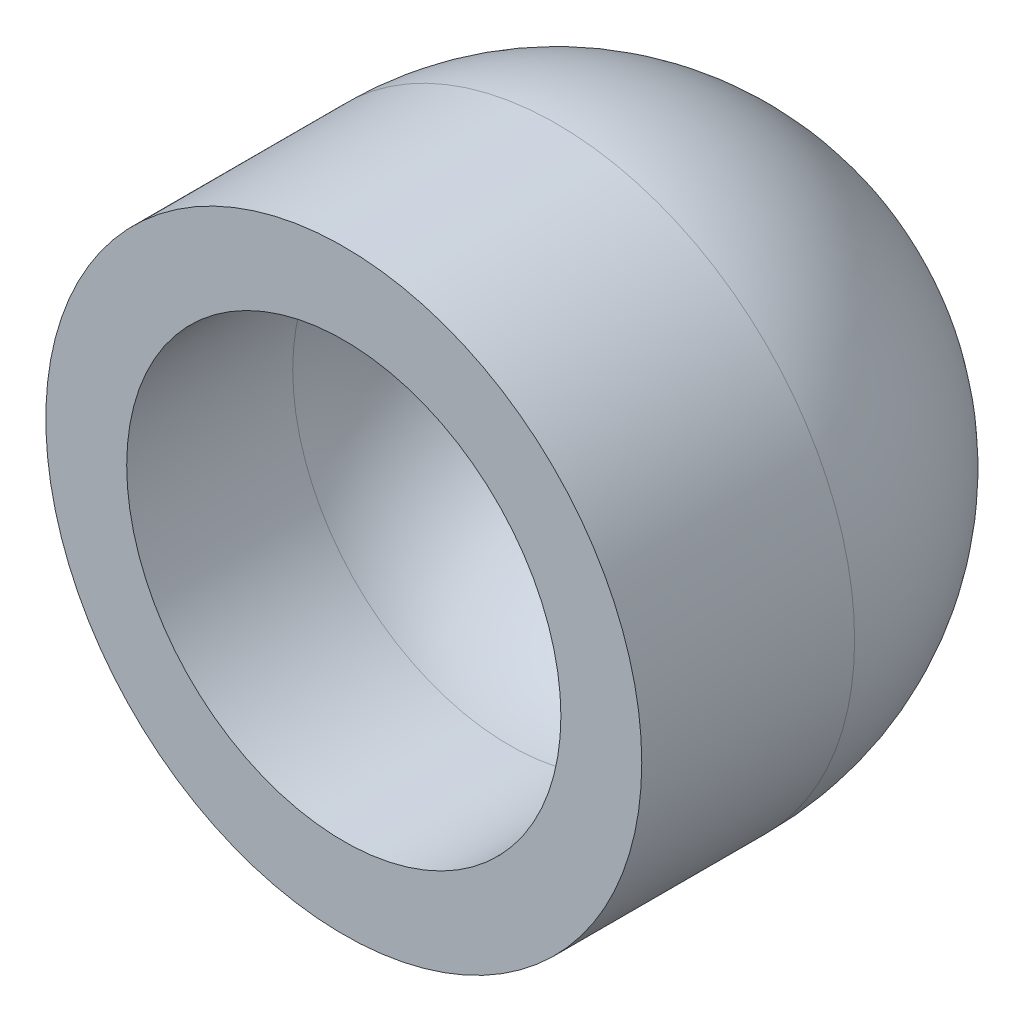
ISO-10303-21;
HEADER;
FILE_DESCRIPTION(('STEP AP214'),'2;1');
FILE_NAME('part.step','',(''),(''),'','','');
FILE_SCHEMA(('AUTOMOTIVE_DESIGN { 1 0 10303 214 1 1 1 1 }'));
ENDSEC;
DATA;
#1=APPLICATION_CONTEXT('core data for automotive mechanical design processes');
#2=APPLICATION_PROTOCOL_DEFINITION('international standard','automotive_design',2000,#1);
#3=PRODUCT_CONTEXT('',#1,'mechanical');
#4=PRODUCT('Part','Part','',(#3));
#5=PRODUCT_RELATED_PRODUCT_CATEGORY('part','',(#4));
#6=PRODUCT_DEFINITION_FORMATION('','',#4);
#7=PRODUCT_DEFINITION_CONTEXT('part definition',#1,'design');
#8=PRODUCT_DEFINITION('design','',#6,#7);
#9=PRODUCT_DEFINITION_SHAPE('','',#8);
#10=(LENGTH_UNIT() NAMED_UNIT(*) SI_UNIT(.MILLI.,.METRE.));
#11=(NAMED_UNIT(*) PLANE_ANGLE_UNIT() SI_UNIT($,.RADIAN.));
#12=(NAMED_UNIT(*) SI_UNIT($,.STERADIAN.) SOLID_ANGLE_UNIT());
#13=UNCERTAINTY_MEASURE_WITH_UNIT(LENGTH_MEASURE(1.E-05),#10,'distance_accuracy_value','');
#14=(GEOMETRIC_REPRESENTATION_CONTEXT(3) GLOBAL_UNCERTAINTY_ASSIGNED_CONTEXT((#13)) GLOBAL_UNIT_ASSIGNED_CONTEXT((#10,
#11,#12)) REPRESENTATION_CONTEXT('',''));
#15=CARTESIAN_POINT('',(0.,0.,0.));
#16=DIRECTION('',(0.,0.,1.));
#17=DIRECTION('',(1.,0.,0.));
#18=AXIS2_PLACEMENT_3D('',#15,#16,#17);
#19=CARTESIAN_POINT('',(0.,0.,6.477));
#20=DIRECTION('',(0.,0.,1.));
#21=DIRECTION('',(1.,0.,0.));
#22=AXIS2_PLACEMENT_3D('',#19,#20,#21);
#23=SPHERICAL_SURFACE('',#22,6.477);
#24=CARTESIAN_POINT('',(0.,0.,6.477));
#25=DIRECTION('',(0.,0.,1.));
#26=DIRECTION('',(1.,0.,0.));
#27=AXIS2_PLACEMENT_3D('',#24,#25,#26);
#28=CIRCLE('',#27,6.477);
#29=CARTESIAN_POINT('',(6.477,0.,6.477));
#30=VERTEX_POINT('',#29);
#31=EDGE_CURVE('E44',#30,#30,#28,.T.);
#32=ORIENTED_EDGE('',*,*,#31,.T.);
#33=EDGE_LOOP('',(#32));
#34=FACE_BOUND('',#33,.T.);
#35=ADVANCED_FACE('F30',(#34),#23,.F.);
#36=CARTESIAN_POINT('',(0.,0.,5.08));
#37=DIRECTION('',(0.,0.,1.));
#38=DIRECTION('',(1.,0.,0.));
#39=AXIS2_PLACEMENT_3D('',#36,#37,#38);
#40=SPHERICAL_SURFACE('',#39,8.89);
#41=CARTESIAN_POINT('',(0.,0.,5.08));
#42=DIRECTION('',(0.,0.,1.));
#43=DIRECTION('',(1.,0.,0.));
#44=AXIS2_PLACEMENT_3D('',#41,#42,#43);
#45=CIRCLE('',#44,8.89);
#46=CARTESIAN_POINT('',(8.89,0.,5.08));
#47=VERTEX_POINT('',#46);
#48=EDGE_CURVE('E10',#47,#47,#45,.T.);
#49=ORIENTED_EDGE('',*,*,#48,.F.);
#50=EDGE_LOOP('',(#49));
#51=FACE_BOUND('',#50,.T.);
#52=ADVANCED_FACE('F62',(#51),#40,.T.);
#53=CARTESIAN_POINT('',(0.,0.,0.));
#54=DIRECTION('',(0.,0.,1.));
#55=DIRECTION('',(1.,0.,0.));
#56=AXIS2_PLACEMENT_3D('',#53,#54,#55);
#57=CYLINDRICAL_SURFACE('',#56,8.89);
#58=ORIENTED_EDGE('',*,*,#48,.T.);
#59=EDGE_LOOP('',(#58));
#60=FACE_BOUND('',#59,.T.);
#61=CARTESIAN_POINT('',(0.,0.,11.43));
#62=DIRECTION('',(0.,0.,1.));
#63=DIRECTION('',(1.,0.,0.));
#64=AXIS2_PLACEMENT_3D('',#61,#62,#63);
#65=CIRCLE('',#64,8.89);
#66=CARTESIAN_POINT('',(8.89,0.,11.43));
#67=VERTEX_POINT('',#66);
#68=EDGE_CURVE('E36',#67,#67,#65,.T.);
#69=ORIENTED_EDGE('',*,*,#68,.F.);
#70=EDGE_LOOP('',(#69));
#71=FACE_BOUND('',#70,.T.);
#72=ADVANCED_FACE('F59',(#60,#71),#57,.T.);
#73=CARTESIAN_POINT('',(6.477,0.,11.43));
#74=DIRECTION('',(0.,0.,1.));
#75=DIRECTION('',(1.,0.,0.));
#76=AXIS2_PLACEMENT_3D('',#73,#74,#75);
#77=PLANE('',#76);
#78=ORIENTED_EDGE('',*,*,#68,.T.);
#79=EDGE_LOOP('',(#78));
#80=FACE_BOUND('',#79,.T.);
#81=CARTESIAN_POINT('',(0.,0.,11.43));
#82=DIRECTION('',(0.,0.,1.));
#83=DIRECTION('',(1.,0.,0.));
#84=AXIS2_PLACEMENT_3D('',#81,#82,#83);
#85=CIRCLE('',#84,6.477);
#86=CARTESIAN_POINT('',(6.477,0.,11.43));
#87=VERTEX_POINT('',#86);
#88=EDGE_CURVE('E40',#87,#87,#85,.T.);
#89=ORIENTED_EDGE('',*,*,#88,.F.);
#90=EDGE_LOOP('',(#89));
#91=FACE_BOUND('',#90,.T.);
#92=ADVANCED_FACE('F53',(#80,#91),#77,.T.);
#93=CARTESIAN_POINT('',(0.,0.,0.));
#94=DIRECTION('',(0.,0.,1.));
#95=DIRECTION('',(1.,0.,0.));
#96=AXIS2_PLACEMENT_3D('',#93,#94,#95);
#97=CYLINDRICAL_SURFACE('',#96,6.477);
#98=ORIENTED_EDGE('',*,*,#88,.T.);
#99=EDGE_LOOP('',(#98));
#100=FACE_BOUND('',#99,.T.);
#101=ORIENTED_EDGE('',*,*,#31,.F.);
#102=EDGE_LOOP('',(#101));
#103=FACE_BOUND('',#102,.T.);
#104=ADVANCED_FACE('F51',(#100,#103),#97,.F.);
#105=CLOSED_SHELL('',(#35,#52,#72,#92,#104));
#106=MANIFOLD_SOLID_BREP('B2',#105);
#107=ADVANCED_BREP_SHAPE_REPRESENTATION('',(#18,#106),#14);
#108=SHAPE_DEFINITION_REPRESENTATION(#9,#107);
ENDSEC;
END-ISO-10303-21;
